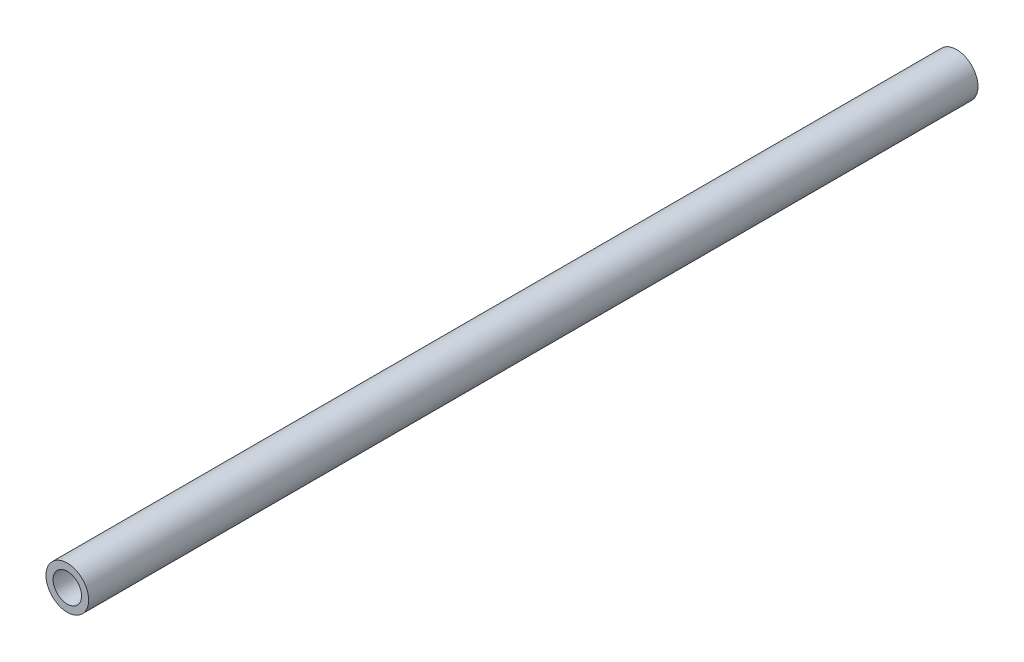
ISO-10303-21;
HEADER;
FILE_DESCRIPTION(('STEP AP214'),'2;1');
FILE_NAME('part.step','',(''),(''),'','','');
FILE_SCHEMA(('AUTOMOTIVE_DESIGN { 1 0 10303 214 1 1 1 1 }'));
ENDSEC;
DATA;
#1=APPLICATION_CONTEXT('core data for automotive mechanical design processes');
#2=APPLICATION_PROTOCOL_DEFINITION('international standard','automotive_design',2000,#1);
#3=PRODUCT_CONTEXT('',#1,'mechanical');
#4=PRODUCT('Part','Part','',(#3));
#5=PRODUCT_RELATED_PRODUCT_CATEGORY('part','',(#4));
#6=PRODUCT_DEFINITION_FORMATION('','',#4);
#7=PRODUCT_DEFINITION_CONTEXT('part definition',#1,'design');
#8=PRODUCT_DEFINITION('design','',#6,#7);
#9=PRODUCT_DEFINITION_SHAPE('','',#8);
#10=(LENGTH_UNIT() NAMED_UNIT(*) SI_UNIT(.MILLI.,.METRE.));
#11=(NAMED_UNIT(*) PLANE_ANGLE_UNIT() SI_UNIT($,.RADIAN.));
#12=(NAMED_UNIT(*) SI_UNIT($,.STERADIAN.) SOLID_ANGLE_UNIT());
#13=UNCERTAINTY_MEASURE_WITH_UNIT(LENGTH_MEASURE(1.E-05),#10,'distance_accuracy_value','');
#14=(GEOMETRIC_REPRESENTATION_CONTEXT(3) GLOBAL_UNCERTAINTY_ASSIGNED_CONTEXT((#13)) GLOBAL_UNIT_ASSIGNED_CONTEXT((#10,
#11,#12)) REPRESENTATION_CONTEXT('',''));
#15=CARTESIAN_POINT('',(0.,0.,0.));
#16=DIRECTION('',(0.,0.,1.));
#17=DIRECTION('',(1.,0.,0.));
#18=AXIS2_PLACEMENT_3D('',#15,#16,#17);
#19=CARTESIAN_POINT('',(0.,0.,125.));
#20=DIRECTION('',(0.,0.,1.));
#21=DIRECTION('',(1.,0.,0.));
#22=AXIS2_PLACEMENT_3D('',#19,#20,#21);
#23=PLANE('',#22);
#24=CARTESIAN_POINT('',(0.,0.,125.));
#25=DIRECTION('',(0.,0.,1.));
#26=DIRECTION('',(1.,0.,0.));
#27=AXIS2_PLACEMENT_3D('',#24,#25,#26);
#28=CIRCLE('',#27,3.);
#29=CARTESIAN_POINT('',(3.,0.,125.));
#30=VERTEX_POINT('',#29);
#31=EDGE_CURVE('E10',#30,#30,#28,.T.);
#32=ORIENTED_EDGE('',*,*,#31,.T.);
#33=EDGE_LOOP('',(#32));
#34=FACE_BOUND('',#33,.T.);
#35=CARTESIAN_POINT('',(0.,0.,125.));
#36=DIRECTION('',(0.,0.,1.));
#37=DIRECTION('',(1.,0.,0.));
#38=AXIS2_PLACEMENT_3D('',#35,#36,#37);
#39=CIRCLE('',#38,2.);
#40=CARTESIAN_POINT('',(2.,0.,125.));
#41=VERTEX_POINT('',#40);
#42=EDGE_CURVE('E56',#41,#41,#39,.T.);
#43=ORIENTED_EDGE('',*,*,#42,.F.);
#44=EDGE_LOOP('',(#43));
#45=FACE_BOUND('',#44,.T.);
#46=ADVANCED_FACE('F43',(#34,#45),#23,.T.);
#47=CARTESIAN_POINT('',(0.,0.,0.));
#48=DIRECTION('',(0.,0.,1.));
#49=DIRECTION('',(1.,0.,0.));
#50=AXIS2_PLACEMENT_3D('',#47,#48,#49);
#51=PLANE('',#50);
#52=CARTESIAN_POINT('',(0.,0.,0.));
#53=DIRECTION('',(0.,0.,1.));
#54=DIRECTION('',(1.,0.,0.));
#55=AXIS2_PLACEMENT_3D('',#52,#53,#54);
#56=CIRCLE('',#55,3.);
#57=CARTESIAN_POINT('',(3.,0.,0.));
#58=VERTEX_POINT('',#57);
#59=EDGE_CURVE('E47',#58,#58,#56,.T.);
#60=ORIENTED_EDGE('',*,*,#59,.F.);
#61=EDGE_LOOP('',(#60));
#62=FACE_BOUND('',#61,.T.);
#63=CARTESIAN_POINT('',(0.,0.,0.));
#64=DIRECTION('',(0.,0.,1.));
#65=DIRECTION('',(1.,0.,0.));
#66=AXIS2_PLACEMENT_3D('',#63,#64,#65);
#67=CIRCLE('',#66,2.);
#68=CARTESIAN_POINT('',(2.,0.,0.));
#69=VERTEX_POINT('',#68);
#70=EDGE_CURVE('E58',#69,#69,#67,.T.);
#71=ORIENTED_EDGE('',*,*,#70,.T.);
#72=EDGE_LOOP('',(#71));
#73=FACE_BOUND('',#72,.T.);
#74=ADVANCED_FACE('F70',(#62,#73),#51,.F.);
#75=CARTESIAN_POINT('',(0.,0.,125.));
#76=DIRECTION('',(0.,0.,-1.));
#77=DIRECTION('',(-1.,0.,0.));
#78=AXIS2_PLACEMENT_3D('',#75,#76,#77);
#79=CYLINDRICAL_SURFACE('',#78,3.);
#80=ORIENTED_EDGE('',*,*,#31,.F.);
#81=EDGE_LOOP('',(#80));
#82=FACE_BOUND('',#81,.T.);
#83=ORIENTED_EDGE('',*,*,#59,.T.);
#84=EDGE_LOOP('',(#83));
#85=FACE_BOUND('',#84,.T.);
#86=ADVANCED_FACE('F45',(#82,#85),#79,.T.);
#87=CARTESIAN_POINT('',(0.,0.,125.));
#88=DIRECTION('',(0.,0.,-1.));
#89=DIRECTION('',(-1.,0.,0.));
#90=AXIS2_PLACEMENT_3D('',#87,#88,#89);
#91=CYLINDRICAL_SURFACE('',#90,2.);
#92=ORIENTED_EDGE('',*,*,#42,.T.);
#93=EDGE_LOOP('',(#92));
#94=FACE_BOUND('',#93,.T.);
#95=ORIENTED_EDGE('',*,*,#70,.F.);
#96=EDGE_LOOP('',(#95));
#97=FACE_BOUND('',#96,.T.);
#98=ADVANCED_FACE('F66',(#94,#97),#91,.F.);
#99=CLOSED_SHELL('',(#46,#74,#86,#98));
#100=MANIFOLD_SOLID_BREP('B2',#99);
#101=ADVANCED_BREP_SHAPE_REPRESENTATION('',(#18,#100),#14);
#102=SHAPE_DEFINITION_REPRESENTATION(#9,#101);
ENDSEC;
END-ISO-10303-21;
